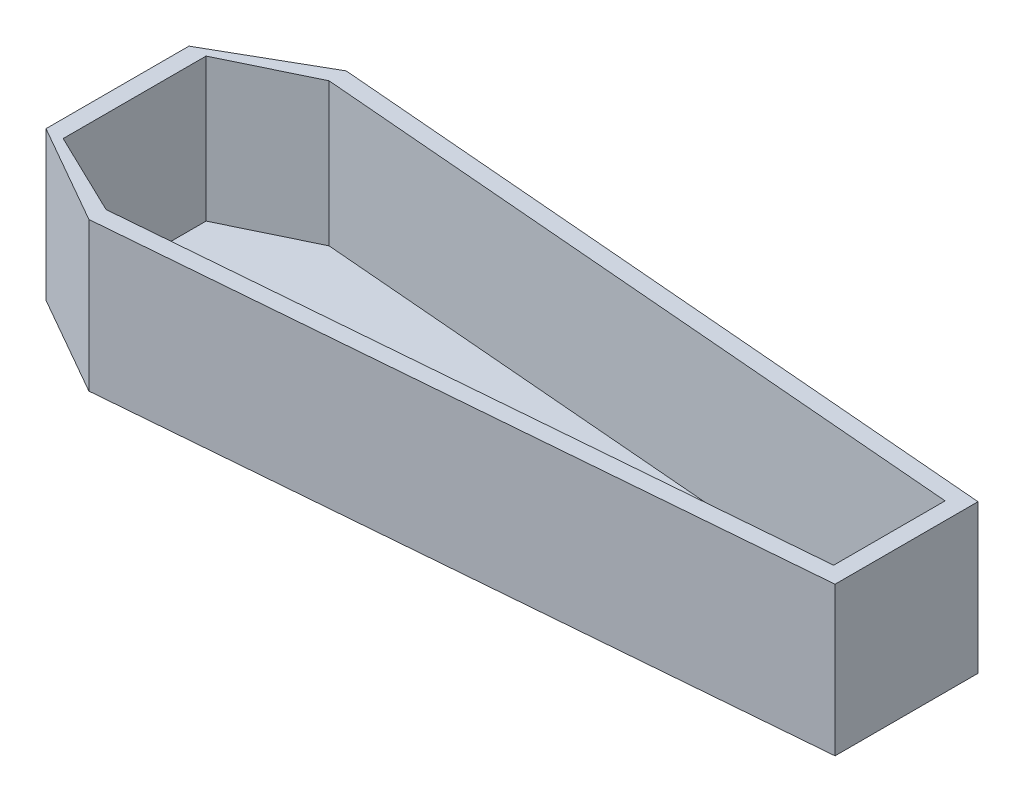
ISO-10303-21;
HEADER;
FILE_DESCRIPTION(('STEP AP214'),'2;1');
FILE_NAME('part.step','',(''),(''),'','','');
FILE_SCHEMA(('AUTOMOTIVE_DESIGN { 1 0 10303 214 1 1 1 1 }'));
ENDSEC;
DATA;
#1=APPLICATION_CONTEXT('core data for automotive mechanical design processes');
#2=APPLICATION_PROTOCOL_DEFINITION('international standard','automotive_design',2000,#1);
#3=PRODUCT_CONTEXT('',#1,'mechanical');
#4=PRODUCT('Part','Part','',(#3));
#5=PRODUCT_RELATED_PRODUCT_CATEGORY('part','',(#4));
#6=PRODUCT_DEFINITION_FORMATION('','',#4);
#7=PRODUCT_DEFINITION_CONTEXT('part definition',#1,'design');
#8=PRODUCT_DEFINITION('design','',#6,#7);
#9=PRODUCT_DEFINITION_SHAPE('','',#8);
#10=(LENGTH_UNIT() NAMED_UNIT(*) SI_UNIT(.MILLI.,.METRE.));
#11=(NAMED_UNIT(*) PLANE_ANGLE_UNIT() SI_UNIT($,.RADIAN.));
#12=(NAMED_UNIT(*) SI_UNIT($,.STERADIAN.) SOLID_ANGLE_UNIT());
#13=UNCERTAINTY_MEASURE_WITH_UNIT(LENGTH_MEASURE(1.E-05),#10,'distance_accuracy_value','');
#14=(GEOMETRIC_REPRESENTATION_CONTEXT(3) GLOBAL_UNCERTAINTY_ASSIGNED_CONTEXT((#13)) GLOBAL_UNIT_ASSIGNED_CONTEXT((#10,
#11,#12)) REPRESENTATION_CONTEXT('',''));
#15=CARTESIAN_POINT('',(0.,0.,0.));
#16=DIRECTION('',(0.,0.,1.));
#17=DIRECTION('',(1.,0.,0.));
#18=AXIS2_PLACEMENT_3D('',#15,#16,#17);
#19=CARTESIAN_POINT('',(-57.7335057076189,50.,-101.033634988333));
#20=DIRECTION('',(-0.496138938356834,0.,-0.868243142124459));
#21=DIRECTION('',(-0.868243142124459,0.,0.496138938356834));
#22=AXIS2_PLACEMENT_3D('',#19,#20,#21);
#23=PLANE('',#22);
#24=DIRECTION('',(0.,-1.,0.));
#25=VECTOR('',#24,1.);
#26=CARTESIAN_POINT('',(-148.684110884635,50.,-49.0618606014667));
#27=LINE('',#26,#25);
#28=CARTESIAN_POINT('',(-148.684110884635,50.,-49.0618606014667));
#29=VERTEX_POINT('',#28);
#30=CARTESIAN_POINT('',(-148.684110884635,-2.,-49.0618606014667));
#31=VERTEX_POINT('',#30);
#32=EDGE_CURVE('E53',#29,#31,#27,.T.);
#33=ORIENTED_EDGE('',*,*,#32,.T.);
#34=DIRECTION('',(0.868243142124459,0.,-0.496138938356833));
#35=VECTOR('',#34,1.);
#36=CARTESIAN_POINT('',(-183.684110884635,-2.,-29.0618606014667));
#37=LINE('',#36,#35);
#38=CARTESIAN_POINT('',(-183.684110884635,-2.,-29.0618606014667));
#39=VERTEX_POINT('',#38);
#40=EDGE_CURVE('E247',#39,#31,#37,.T.);
#41=ORIENTED_EDGE('',*,*,#40,.F.);
#42=DIRECTION('',(0.,-1.,0.));
#43=VECTOR('',#42,1.);
#44=CARTESIAN_POINT('',(-183.684110884635,50.,-29.0618606014667));
#45=LINE('',#44,#43);
#46=CARTESIAN_POINT('',(-183.684110884635,50.,-29.0618606014667));
#47=VERTEX_POINT('',#46);
#48=EDGE_CURVE('E11',#47,#39,#45,.T.);
#49=ORIENTED_EDGE('',*,*,#48,.F.);
#50=DIRECTION('',(0.868243142124459,0.,-0.496138938356834));
#51=VECTOR('',#50,1.);
#52=CARTESIAN_POINT('',(-57.7335057076189,50.,-101.033634988333));
#53=LINE('',#52,#51);
#54=EDGE_CURVE('E210',#47,#29,#53,.T.);
#55=ORIENTED_EDGE('',*,*,#54,.T.);
#56=EDGE_LOOP('',(#33,#41,#49,#55));
#57=FACE_BOUND('',#56,.T.);
#58=ADVANCED_FACE('F34',(#57),#23,.T.);
#59=CARTESIAN_POINT('',(-183.684110884635,50.,0.));
#60=DIRECTION('',(1.,0.,0.));
#61=DIRECTION('',(0.,0.,-1.));
#62=AXIS2_PLACEMENT_3D('',#59,#60,#61);
#63=PLANE('',#62);
#64=ORIENTED_EDGE('',*,*,#48,.T.);
#65=DIRECTION('',(0.,0.,-1.));
#66=VECTOR('',#65,1.);
#67=CARTESIAN_POINT('',(-183.684110884635,-2.,20.9381393985333));
#68=LINE('',#67,#66);
#69=CARTESIAN_POINT('',(-183.684110884635,-2.,20.9381393985333));
#70=VERTEX_POINT('',#69);
#71=EDGE_CURVE('E220',#70,#39,#68,.T.);
#72=ORIENTED_EDGE('',*,*,#71,.F.);
#73=DIRECTION('',(0.,-1.,0.));
#74=VECTOR('',#73,1.);
#75=CARTESIAN_POINT('',(-183.684110884635,50.,20.9381393985333));
#76=LINE('',#75,#74);
#77=CARTESIAN_POINT('',(-183.684110884635,50.,20.9381393985333));
#78=VERTEX_POINT('',#77);
#79=EDGE_CURVE('E44',#78,#70,#76,.T.);
#80=ORIENTED_EDGE('',*,*,#79,.F.);
#81=DIRECTION('',(0.,0.,1.));
#82=VECTOR('',#81,1.);
#83=CARTESIAN_POINT('',(-183.684110884635,50.,0.));
#84=LINE('',#83,#82);
#85=EDGE_CURVE('E212',#47,#78,#84,.T.);
#86=ORIENTED_EDGE('',*,*,#85,.F.);
#87=EDGE_LOOP('',(#64,#72,#80,#86));
#88=FACE_BOUND('',#87,.T.);
#89=ADVANCED_FACE('F217',(#88),#63,.F.);
#90=CARTESIAN_POINT('',(-54.2340565740476,50.,94.9095990045833));
#91=DIRECTION('',(0.496138938356834,0.,-0.868243142124459));
#92=DIRECTION('',(-0.868243142124459,0.,-0.496138938356834));
#93=AXIS2_PLACEMENT_3D('',#90,#91,#92);
#94=PLANE('',#93);
#95=ORIENTED_EDGE('',*,*,#79,.T.);
#96=DIRECTION('',(-0.868243142124459,0.,-0.496138938356833));
#97=VECTOR('',#96,1.);
#98=CARTESIAN_POINT('',(-148.684110884635,-2.,40.9381393985333));
#99=LINE('',#98,#97);
#100=CARTESIAN_POINT('',(-148.684110884635,-2.,40.9381393985333));
#101=VERTEX_POINT('',#100);
#102=EDGE_CURVE('E226',#101,#70,#99,.T.);
#103=ORIENTED_EDGE('',*,*,#102,.F.);
#104=DIRECTION('',(0.,-1.,0.));
#105=VECTOR('',#104,1.);
#106=CARTESIAN_POINT('',(-148.684110884635,50.,40.9381393985333));
#107=LINE('',#106,#105);
#108=CARTESIAN_POINT('',(-148.684110884635,50.,40.9381393985333));
#109=VERTEX_POINT('',#108);
#110=EDGE_CURVE('E142',#109,#101,#107,.T.);
#111=ORIENTED_EDGE('',*,*,#110,.F.);
#112=DIRECTION('',(0.868243142124459,0.,0.496138938356834));
#113=VECTOR('',#112,1.);
#114=CARTESIAN_POINT('',(-54.2340565740476,50.,94.9095990045833));
#115=LINE('',#114,#113);
#116=EDGE_CURVE('E127',#78,#109,#115,.T.);
#117=ORIENTED_EDGE('',*,*,#116,.F.);
#118=EDGE_LOOP('',(#95,#103,#111,#117));
#119=FACE_BOUND('',#118,.T.);
#120=ADVANCED_FACE('F224',(#119),#94,.F.);
#121=CARTESIAN_POINT('',(2.35719148124103,50.,28.40314450992));
#122=DIRECTION('',(-0.0827061835687407,0.,-0.996573974775327));
#123=DIRECTION('',(-0.996573974775327,0.,0.0827061835687407));
#124=AXIS2_PLACEMENT_3D('',#121,#122,#123);
#125=PLANE('',#124);
#126=ORIENTED_EDGE('',*,*,#110,.T.);
#127=DIRECTION('',(-0.996573974775327,0.,0.0827061835687407));
#128=VECTOR('',#127,1.);
#129=CARTESIAN_POINT('',(92.3072955068908,-2.,20.9381393985333));
#130=LINE('',#129,#128);
#131=CARTESIAN_POINT('',(92.3072955068908,-2.,20.9381393985333));
#132=VERTEX_POINT('',#131);
#133=EDGE_CURVE('E138',#132,#101,#130,.T.);
#134=ORIENTED_EDGE('',*,*,#133,.F.);
#135=DIRECTION('',(0.,-1.,0.));
#136=VECTOR('',#135,1.);
#137=CARTESIAN_POINT('',(92.3072955068908,50.,20.9381393985333));
#138=LINE('',#137,#136);
#139=CARTESIAN_POINT('',(92.3072955068908,50.,20.9381393985333));
#140=VERTEX_POINT('',#139);
#141=EDGE_CURVE('E134',#140,#132,#138,.T.);
#142=ORIENTED_EDGE('',*,*,#141,.F.);
#143=DIRECTION('',(0.996573974775327,0.,-0.0827061835687407));
#144=VECTOR('',#143,1.);
#145=CARTESIAN_POINT('',(2.35719148124103,50.,28.40314450992));
#146=LINE('',#145,#144);
#147=EDGE_CURVE('E119',#109,#140,#146,.T.);
#148=ORIENTED_EDGE('',*,*,#147,.F.);
#149=EDGE_LOOP('',(#126,#134,#142,#148));
#150=FACE_BOUND('',#149,.T.);
#151=ADVANCED_FACE('F135',(#150),#125,.F.);
#152=CARTESIAN_POINT('',(92.3072955068908,50.,0.));
#153=DIRECTION('',(1.,0.,0.));
#154=DIRECTION('',(0.,0.,-1.));
#155=AXIS2_PLACEMENT_3D('',#152,#153,#154);
#156=PLANE('',#155);
#157=ORIENTED_EDGE('',*,*,#141,.T.);
#158=DIRECTION('',(0.,0.,1.));
#159=VECTOR('',#158,1.);
#160=CARTESIAN_POINT('',(92.3072955068908,-2.,-29.0618606014667));
#161=LINE('',#160,#159);
#162=CARTESIAN_POINT('',(92.3072955068908,-2.,-29.0618606014667));
#163=VERTEX_POINT('',#162);
#164=EDGE_CURVE('E242',#163,#132,#161,.T.);
#165=ORIENTED_EDGE('',*,*,#164,.F.);
#166=DIRECTION('',(0.,-1.,0.));
#167=VECTOR('',#166,1.);
#168=CARTESIAN_POINT('',(92.3072955068908,50.,-29.0618606014667));
#169=LINE('',#168,#167);
#170=CARTESIAN_POINT('',(92.3072955068908,50.,-29.0618606014667));
#171=VERTEX_POINT('',#170);
#172=EDGE_CURVE('E143',#171,#163,#169,.T.);
#173=ORIENTED_EDGE('',*,*,#172,.F.);
#174=DIRECTION('',(0.,0.,1.));
#175=VECTOR('',#174,1.);
#176=CARTESIAN_POINT('',(92.3072955068908,50.,0.));
#177=LINE('',#176,#175);
#178=EDGE_CURVE('E125',#171,#140,#177,.T.);
#179=ORIENTED_EDGE('',*,*,#178,.T.);
#180=EDGE_LOOP('',(#157,#165,#173,#179));
#181=FACE_BOUND('',#180,.T.);
#182=ADVANCED_FACE('F145',(#181),#156,.T.);
#183=CARTESIAN_POINT('',(-177.684110884635,50.,0.));
#184=DIRECTION('',(-1.,0.,0.));
#185=DIRECTION('',(0.,0.,1.));
#186=AXIS2_PLACEMENT_3D('',#183,#184,#185);
#187=PLANE('',#186);
#188=DIRECTION('',(0.,0.,-1.));
#189=VECTOR('',#188,1.);
#190=CARTESIAN_POINT('',(-177.684110884635,0.,0.));
#191=LINE('',#190,#189);
#192=CARTESIAN_POINT('',(-177.684110884635,0.,20.9381393985333));
#193=VERTEX_POINT('',#192);
#194=CARTESIAN_POINT('',(-177.684110884635,0.,-29.0618606014667));
#195=VERTEX_POINT('',#194);
#196=EDGE_CURVE('E152',#193,#195,#191,.T.);
#197=ORIENTED_EDGE('',*,*,#196,.T.);
#198=DIRECTION('',(0.,-1.,0.));
#199=VECTOR('',#198,1.);
#200=CARTESIAN_POINT('',(-177.684110884635,50.,-29.0618606014667));
#201=LINE('',#200,#199);
#202=CARTESIAN_POINT('',(-177.684110884635,50.,-29.0618606014667));
#203=VERTEX_POINT('',#202);
#204=EDGE_CURVE('E38',#203,#195,#201,.T.);
#205=ORIENTED_EDGE('',*,*,#204,.F.);
#206=DIRECTION('',(0.,0.,-1.));
#207=VECTOR('',#206,1.);
#208=CARTESIAN_POINT('',(-177.684110884635,50.,0.));
#209=LINE('',#208,#207);
#210=CARTESIAN_POINT('',(-177.684110884635,50.,20.9381393985333));
#211=VERTEX_POINT('',#210);
#212=EDGE_CURVE('E168',#211,#203,#209,.T.);
#213=ORIENTED_EDGE('',*,*,#212,.F.);
#214=DIRECTION('',(0.,-1.,0.));
#215=VECTOR('',#214,1.);
#216=CARTESIAN_POINT('',(-177.684110884635,50.,20.9381393985333));
#217=LINE('',#216,#215);
#218=EDGE_CURVE('E83',#211,#193,#217,.T.);
#219=ORIENTED_EDGE('',*,*,#218,.T.);
#220=EDGE_LOOP('',(#197,#205,#213,#219));
#221=FACE_BOUND('',#220,.T.);
#222=ADVANCED_FACE('F36',(#221),#187,.F.);
#223=CARTESIAN_POINT('',(-44.9616211548543,50.,-93.1347866779125));
#224=DIRECTION('',(-0.434749065831176,0.,-0.900551636364578));
#225=DIRECTION('',(-0.900551636364578,0.,0.434749065831176));
#226=AXIS2_PLACEMENT_3D('',#223,#224,#225);
#227=PLANE('',#226);
#228=DIRECTION('',(0.900551636364578,0.,-0.434749065831176));
#229=VECTOR('',#228,1.);
#230=CARTESIAN_POINT('',(-44.9616211548543,0.,-93.1347866779125));
#231=LINE('',#230,#229);
#232=CARTESIAN_POINT('',(-148.684110884635,0.,-43.0618606014667));
#233=VERTEX_POINT('',#232);
#234=EDGE_CURVE('E154',#195,#233,#231,.T.);
#235=ORIENTED_EDGE('',*,*,#234,.T.);
#236=DIRECTION('',(0.,-1.,0.));
#237=VECTOR('',#236,1.);
#238=CARTESIAN_POINT('',(-148.684110884635,50.,-43.0618606014667));
#239=LINE('',#238,#237);
#240=CARTESIAN_POINT('',(-148.684110884635,50.,-43.0618606014667));
#241=VERTEX_POINT('',#240);
#242=EDGE_CURVE('E180',#241,#233,#239,.T.);
#243=ORIENTED_EDGE('',*,*,#242,.F.);
#244=DIRECTION('',(0.900551636364578,0.,-0.434749065831176));
#245=VECTOR('',#244,1.);
#246=CARTESIAN_POINT('',(-44.9616211548543,50.,-93.1347866779125));
#247=LINE('',#246,#245);
#248=EDGE_CURVE('E91',#203,#241,#247,.T.);
#249=ORIENTED_EDGE('',*,*,#248,.F.);
#250=ORIENTED_EDGE('',*,*,#204,.T.);
#251=EDGE_LOOP('',(#235,#243,#249,#250));
#252=FACE_BOUND('',#251,.T.);
#253=ADVANCED_FACE('F186',(#252),#227,.F.);
#254=CARTESIAN_POINT('',(2.53223459312507,50.,-30.5123387955242));
#255=DIRECTION('',(0.0827061835687408,0.,-0.996573974775327));
#256=DIRECTION('',(-0.996573974775327,0.,-0.0827061835687408));
#257=AXIS2_PLACEMENT_3D('',#254,#255,#256);
#258=PLANE('',#257);
#259=DIRECTION('',(0.996573974775327,0.,0.0827061835687408));
#260=VECTOR('',#259,1.);
#261=CARTESIAN_POINT('',(2.53223459312507,0.,-30.5123387955242));
#262=LINE('',#261,#260);
#263=CARTESIAN_POINT('',(86.3072955068908,0.,-23.5598036683868));
#264=VERTEX_POINT('',#263);
#265=EDGE_CURVE('E156',#233,#264,#262,.T.);
#266=ORIENTED_EDGE('',*,*,#265,.T.);
#267=DIRECTION('',(0.,-1.,0.));
#268=VECTOR('',#267,1.);
#269=CARTESIAN_POINT('',(86.3072955068908,50.,-23.5598036683868));
#270=LINE('',#269,#268);
#271=CARTESIAN_POINT('',(86.3072955068908,50.,-23.5598036683868));
#272=VERTEX_POINT('',#271);
#273=EDGE_CURVE('E179',#272,#264,#270,.T.);
#274=ORIENTED_EDGE('',*,*,#273,.F.);
#275=DIRECTION('',(0.996573974775327,0.,0.0827061835687408));
#276=VECTOR('',#275,1.);
#277=CARTESIAN_POINT('',(2.53223459312507,50.,-30.5123387955242));
#278=LINE('',#277,#276);
#279=EDGE_CURVE('E194',#241,#272,#278,.T.);
#280=ORIENTED_EDGE('',*,*,#279,.F.);
#281=ORIENTED_EDGE('',*,*,#242,.T.);
#282=EDGE_LOOP('',(#266,#274,#280,#281));
#283=FACE_BOUND('',#282,.T.);
#284=ADVANCED_FACE('F192',(#283),#258,.F.);
#285=CARTESIAN_POINT('',(86.3072955068908,50.,0.));
#286=DIRECTION('',(-1.,0.,0.));
#287=DIRECTION('',(0.,0.,1.));
#288=AXIS2_PLACEMENT_3D('',#285,#286,#287);
#289=PLANE('',#288);
#290=DIRECTION('',(0.,0.,-1.));
#291=VECTOR('',#290,1.);
#292=CARTESIAN_POINT('',(86.3072955068908,0.,0.));
#293=LINE('',#292,#291);
#294=CARTESIAN_POINT('',(86.3072955068908,0.,15.4360824654535));
#295=VERTEX_POINT('',#294);
#296=EDGE_CURVE('E159',#295,#264,#293,.T.);
#297=ORIENTED_EDGE('',*,*,#296,.F.);
#298=DIRECTION('',(0.,-1.,0.));
#299=VECTOR('',#298,1.);
#300=CARTESIAN_POINT('',(86.3072955068908,50.,15.4360824654535));
#301=LINE('',#300,#299);
#302=CARTESIAN_POINT('',(86.3072955068908,50.,15.4360824654535));
#303=VERTEX_POINT('',#302);
#304=EDGE_CURVE('E75',#303,#295,#301,.T.);
#305=ORIENTED_EDGE('',*,*,#304,.F.);
#306=DIRECTION('',(0.,0.,-1.));
#307=VECTOR('',#306,1.);
#308=CARTESIAN_POINT('',(86.3072955068908,50.,0.));
#309=LINE('',#308,#307);
#310=EDGE_CURVE('E197',#303,#272,#309,.T.);
#311=ORIENTED_EDGE('',*,*,#310,.T.);
#312=ORIENTED_EDGE('',*,*,#273,.T.);
#313=EDGE_LOOP('',(#297,#305,#311,#312));
#314=FACE_BOUND('',#313,.T.);
#315=ADVANCED_FACE('F198',(#314),#289,.T.);
#316=CARTESIAN_POINT('',(1.86265450065544,50.,22.444186386723));
#317=DIRECTION('',(-0.0827061835687407,0.,-0.996573974775327));
#318=DIRECTION('',(-0.996573974775327,0.,0.0827061835687407));
#319=AXIS2_PLACEMENT_3D('',#316,#317,#318);
#320=PLANE('',#319);
#321=DIRECTION('',(0.996573974775327,0.,-0.0827061835687407));
#322=VECTOR('',#321,1.);
#323=CARTESIAN_POINT('',(1.86265450065544,0.,22.444186386723));
#324=LINE('',#323,#322);
#325=CARTESIAN_POINT('',(-148.684110884635,0.,34.9381393985333));
#326=VERTEX_POINT('',#325);
#327=EDGE_CURVE('E162',#326,#295,#324,.T.);
#328=ORIENTED_EDGE('',*,*,#327,.F.);
#329=DIRECTION('',(0.,-1.,0.));
#330=VECTOR('',#329,1.);
#331=CARTESIAN_POINT('',(-148.684110884635,50.,34.9381393985333));
#332=LINE('',#331,#330);
#333=CARTESIAN_POINT('',(-148.684110884635,50.,34.9381393985333));
#334=VERTEX_POINT('',#333);
#335=EDGE_CURVE('E175',#334,#326,#332,.T.);
#336=ORIENTED_EDGE('',*,*,#335,.F.);
#337=DIRECTION('',(0.996573974775327,0.,-0.0827061835687407));
#338=VECTOR('',#337,1.);
#339=CARTESIAN_POINT('',(1.86265450065544,50.,22.444186386723));
#340=LINE('',#339,#338);
#341=EDGE_CURVE('E201',#334,#303,#340,.T.);
#342=ORIENTED_EDGE('',*,*,#341,.T.);
#343=ORIENTED_EDGE('',*,*,#304,.T.);
#344=EDGE_LOOP('',(#328,#336,#342,#343));
#345=FACE_BOUND('',#344,.T.);
#346=ADVANCED_FACE('F235',(#345),#320,.T.);
#347=CARTESIAN_POINT('',(-41.7810707128187,50.,86.5465036194102));
#348=DIRECTION('',(0.434749065831176,0.,-0.900551636364578));
#349=DIRECTION('',(-0.900551636364578,0.,-0.434749065831176));
#350=AXIS2_PLACEMENT_3D('',#347,#348,#349);
#351=PLANE('',#350);
#352=DIRECTION('',(0.900551636364578,0.,0.434749065831176));
#353=VECTOR('',#352,1.);
#354=CARTESIAN_POINT('',(-41.7810707128187,0.,86.5465036194102));
#355=LINE('',#354,#353);
#356=EDGE_CURVE('E165',#193,#326,#355,.T.);
#357=ORIENTED_EDGE('',*,*,#356,.F.);
#358=ORIENTED_EDGE('',*,*,#218,.F.);
#359=DIRECTION('',(0.900551636364578,0.,0.434749065831176));
#360=VECTOR('',#359,1.);
#361=CARTESIAN_POINT('',(-41.7810707128187,50.,86.5465036194102));
#362=LINE('',#361,#360);
#363=EDGE_CURVE('E203',#211,#334,#362,.T.);
#364=ORIENTED_EDGE('',*,*,#363,.T.);
#365=ORIENTED_EDGE('',*,*,#335,.T.);
#366=EDGE_LOOP('',(#357,#358,#364,#365));
#367=FACE_BOUND('',#366,.T.);
#368=ADVANCED_FACE('F237',(#367),#351,.T.);
#369=CARTESIAN_POINT('',(3.02677157371066,50.,-36.4712969187212));
#370=DIRECTION('',(0.0827061835687407,0.,-0.996573974775327));
#371=DIRECTION('',(-0.996573974775327,0.,-0.0827061835687407));
#372=AXIS2_PLACEMENT_3D('',#369,#370,#371);
#373=PLANE('',#372);
#374=ORIENTED_EDGE('',*,*,#172,.T.);
#375=DIRECTION('',(0.996573974775327,0.,0.0827061835687407));
#376=VECTOR('',#375,1.);
#377=CARTESIAN_POINT('',(-148.684110884635,-2.,-49.0618606014667));
#378=LINE('',#377,#376);
#379=EDGE_CURVE('E244',#31,#163,#378,.T.);
#380=ORIENTED_EDGE('',*,*,#379,.F.);
#381=ORIENTED_EDGE('',*,*,#32,.F.);
#382=DIRECTION('',(0.996573974775327,0.,0.0827061835687407));
#383=VECTOR('',#382,1.);
#384=CARTESIAN_POINT('',(3.02677157371066,50.,-36.4712969187212));
#385=LINE('',#384,#383);
#386=EDGE_CURVE('E147',#29,#171,#385,.T.);
#387=ORIENTED_EDGE('',*,*,#386,.T.);
#388=EDGE_LOOP('',(#374,#380,#381,#387));
#389=FACE_BOUND('',#388,.T.);
#390=ADVANCED_FACE('F254',(#389),#373,.T.);
#391=CARTESIAN_POINT('',(0.,50.,0.));
#392=DIRECTION('',(0.,1.,0.));
#393=DIRECTION('',(0.,0.,1.));
#394=AXIS2_PLACEMENT_3D('',#391,#392,#393);
#395=PLANE('',#394);
#396=ORIENTED_EDGE('',*,*,#212,.T.);
#397=ORIENTED_EDGE('',*,*,#248,.T.);
#398=ORIENTED_EDGE('',*,*,#279,.T.);
#399=ORIENTED_EDGE('',*,*,#310,.F.);
#400=ORIENTED_EDGE('',*,*,#341,.F.);
#401=ORIENTED_EDGE('',*,*,#363,.F.);
#402=EDGE_LOOP('',(#396,#397,#398,#399,#400,#401));
#403=FACE_BOUND('',#402,.T.);
#404=ORIENTED_EDGE('',*,*,#54,.F.);
#405=ORIENTED_EDGE('',*,*,#85,.T.);
#406=ORIENTED_EDGE('',*,*,#116,.T.);
#407=ORIENTED_EDGE('',*,*,#147,.T.);
#408=ORIENTED_EDGE('',*,*,#178,.F.);
#409=ORIENTED_EDGE('',*,*,#386,.F.);
#410=EDGE_LOOP('',(#404,#405,#406,#407,#408,#409));
#411=FACE_BOUND('',#410,.T.);
#412=ADVANCED_FACE('F122',(#403,#411),#395,.T.);
#413=CARTESIAN_POINT('',(0.,-2.,0.));
#414=DIRECTION('',(0.,-1.,0.));
#415=DIRECTION('',(0.,0.,-1.));
#416=AXIS2_PLACEMENT_3D('',#413,#414,#415);
#417=PLANE('',#416);
#418=ORIENTED_EDGE('',*,*,#102,.T.);
#419=ORIENTED_EDGE('',*,*,#71,.T.);
#420=ORIENTED_EDGE('',*,*,#40,.T.);
#421=ORIENTED_EDGE('',*,*,#379,.T.);
#422=ORIENTED_EDGE('',*,*,#164,.T.);
#423=ORIENTED_EDGE('',*,*,#133,.T.);
#424=EDGE_LOOP('',(#418,#419,#420,#421,#422,#423));
#425=FACE_BOUND('',#424,.T.);
#426=ADVANCED_FACE('F252',(#425),#417,.T.);
#427=CARTESIAN_POINT('',(0.,0.,0.));
#428=DIRECTION('',(0.,-1.,0.));
#429=DIRECTION('',(0.,0.,-1.));
#430=AXIS2_PLACEMENT_3D('',#427,#428,#429);
#431=PLANE('',#430);
#432=ORIENTED_EDGE('',*,*,#234,.F.);
#433=ORIENTED_EDGE('',*,*,#196,.F.);
#434=ORIENTED_EDGE('',*,*,#356,.T.);
#435=ORIENTED_EDGE('',*,*,#327,.T.);
#436=ORIENTED_EDGE('',*,*,#296,.T.);
#437=ORIENTED_EDGE('',*,*,#265,.F.);
#438=EDGE_LOOP('',(#432,#433,#434,#435,#436,#437));
#439=FACE_BOUND('',#438,.T.);
#440=ADVANCED_FACE('F190',(#439),#431,.F.);
#441=CLOSED_SHELL('',(#58,#89,#120,#151,#182,#222,#253,#284,#315,#346,#368,#390,#412,#426,#440));
#442=MANIFOLD_SOLID_BREP('B2',#441);
#443=ADVANCED_BREP_SHAPE_REPRESENTATION('',(#18,#442),#14);
#444=SHAPE_DEFINITION_REPRESENTATION(#9,#443);
ENDSEC;
END-ISO-10303-21;
